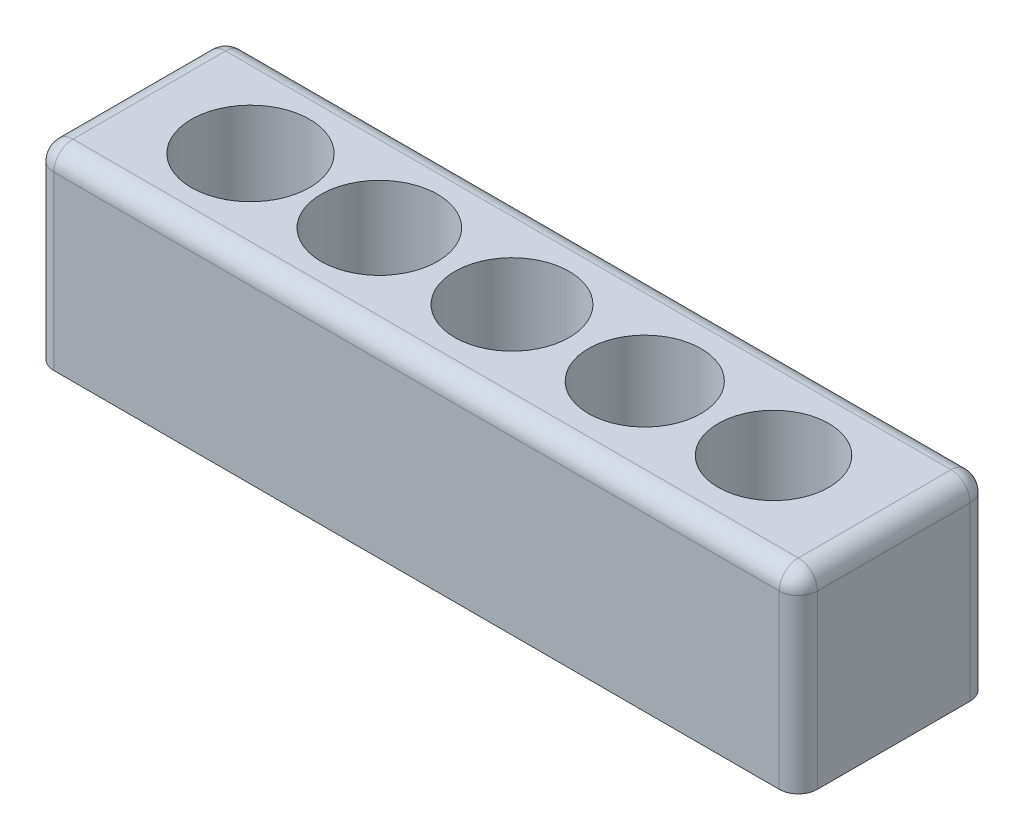
ISO-10303-21;
HEADER;
FILE_DESCRIPTION(('STEP AP214'),'2;1');
FILE_NAME('part.step','',(''),(''),'','','');
FILE_SCHEMA(('AUTOMOTIVE_DESIGN { 1 0 10303 214 1 1 1 1 }'));
ENDSEC;
DATA;
#1=APPLICATION_CONTEXT('core data for automotive mechanical design processes');
#2=APPLICATION_PROTOCOL_DEFINITION('international standard','automotive_design',2000,#1);
#3=PRODUCT_CONTEXT('',#1,'mechanical');
#4=PRODUCT('Part','Part','',(#3));
#5=PRODUCT_RELATED_PRODUCT_CATEGORY('part','',(#4));
#6=PRODUCT_DEFINITION_FORMATION('','',#4);
#7=PRODUCT_DEFINITION_CONTEXT('part definition',#1,'design');
#8=PRODUCT_DEFINITION('design','',#6,#7);
#9=PRODUCT_DEFINITION_SHAPE('','',#8);
#10=(LENGTH_UNIT() NAMED_UNIT(*) SI_UNIT(.MILLI.,.METRE.));
#11=(NAMED_UNIT(*) PLANE_ANGLE_UNIT() SI_UNIT($,.RADIAN.));
#12=(NAMED_UNIT(*) SI_UNIT($,.STERADIAN.) SOLID_ANGLE_UNIT());
#13=UNCERTAINTY_MEASURE_WITH_UNIT(LENGTH_MEASURE(1.E-05),#10,'distance_accuracy_value','');
#14=(GEOMETRIC_REPRESENTATION_CONTEXT(3) GLOBAL_UNCERTAINTY_ASSIGNED_CONTEXT((#13)) GLOBAL_UNIT_ASSIGNED_CONTEXT((#10,
#11,#12)) REPRESENTATION_CONTEXT('',''));
#15=CARTESIAN_POINT('',(0.,0.,0.));
#16=DIRECTION('',(0.,0.,1.));
#17=DIRECTION('',(1.,0.,0.));
#18=AXIS2_PLACEMENT_3D('',#15,#16,#17);
#19=CARTESIAN_POINT('',(-7.37993294009677,5.,2.59456372639682));
#20=DIRECTION('',(0.,0.,-1.));
#21=DIRECTION('',(-1.,0.,0.));
#22=AXIS2_PLACEMENT_3D('',#19,#20,#21);
#23=PLANE('',#22);
#24=DIRECTION('',(1.,0.,0.));
#25=VECTOR('',#24,1.);
#26=CARTESIAN_POINT('',(-8.87993294009677,4.5,2.59456372639682));
#27=LINE('',#26,#25);
#28=CARTESIAN_POINT('',(10.6200670599032,4.5,2.59456372639682));
#29=VERTEX_POINT('',#28);
#30=CARTESIAN_POINT('',(-8.37993294009677,4.5,2.59456372639682));
#31=VERTEX_POINT('',#30);
#32=EDGE_CURVE('E139',#29,#31,#27,.F.);
#33=ORIENTED_EDGE('',*,*,#32,.T.);
#34=DIRECTION('',(0.,1.,0.));
#35=VECTOR('',#34,1.);
#36=CARTESIAN_POINT('',(-8.37993294009677,0.,2.59456372639682));
#37=LINE('',#36,#35);
#38=CARTESIAN_POINT('',(-8.37993294009677,0.,2.59456372639682));
#39=VERTEX_POINT('',#38);
#40=EDGE_CURVE('E135',#31,#39,#37,.F.);
#41=ORIENTED_EDGE('',*,*,#40,.T.);
#42=DIRECTION('',(1.,0.,0.));
#43=VECTOR('',#42,1.);
#44=CARTESIAN_POINT('',(-7.37993294009677,0.,2.59456372639682));
#45=LINE('',#44,#43);
#46=CARTESIAN_POINT('',(10.6200670599032,0.,2.59456372639682));
#47=VERTEX_POINT('',#46);
#48=EDGE_CURVE('E230',#39,#47,#45,.T.);
#49=ORIENTED_EDGE('',*,*,#48,.T.);
#50=DIRECTION('',(0.,-1.,0.));
#51=VECTOR('',#50,1.);
#52=CARTESIAN_POINT('',(10.6200670599032,5.,2.59456372639682));
#53=LINE('',#52,#51);
#54=EDGE_CURVE('E239',#47,#29,#53,.F.);
#55=ORIENTED_EDGE('',*,*,#54,.T.);
#56=EDGE_LOOP('',(#33,#41,#49,#55));
#57=FACE_BOUND('',#56,.T.);
#58=ADVANCED_FACE('F33',(#57),#23,.F.);
#59=CARTESIAN_POINT('',(-7.37993294009677,5.,-2.40543627360318));
#60=DIRECTION('',(0.,0.,1.));
#61=DIRECTION('',(1.,0.,0.));
#62=AXIS2_PLACEMENT_3D('',#59,#60,#61);
#63=PLANE('',#62);
#64=DIRECTION('',(-1.,0.,0.));
#65=VECTOR('',#64,1.);
#66=CARTESIAN_POINT('',(11.1200670599032,4.5,-2.40543627360318));
#67=LINE('',#66,#65);
#68=CARTESIAN_POINT('',(-8.37993294009677,4.5,-2.40543627360318));
#69=VERTEX_POINT('',#68);
#70=CARTESIAN_POINT('',(10.6200670599032,4.5,-2.40543627360318));
#71=VERTEX_POINT('',#70);
#72=EDGE_CURVE('E42',#69,#71,#67,.F.);
#73=ORIENTED_EDGE('',*,*,#72,.T.);
#74=DIRECTION('',(0.,1.,0.));
#75=VECTOR('',#74,1.);
#76=CARTESIAN_POINT('',(10.6200670599032,0.,-2.40543627360318));
#77=LINE('',#76,#75);
#78=CARTESIAN_POINT('',(10.6200670599032,0.,-2.40543627360318));
#79=VERTEX_POINT('',#78);
#80=EDGE_CURVE('E11',#71,#79,#77,.F.);
#81=ORIENTED_EDGE('',*,*,#80,.T.);
#82=DIRECTION('',(-1.,0.,0.));
#83=VECTOR('',#82,1.);
#84=CARTESIAN_POINT('',(-7.37993294009677,0.,-2.40543627360318));
#85=LINE('',#84,#83);
#86=CARTESIAN_POINT('',(-8.37993294009677,0.,-2.40543627360318));
#87=VERTEX_POINT('',#86);
#88=EDGE_CURVE('E121',#79,#87,#85,.T.);
#89=ORIENTED_EDGE('',*,*,#88,.T.);
#90=DIRECTION('',(0.,-1.,0.));
#91=VECTOR('',#90,1.);
#92=CARTESIAN_POINT('',(-8.37993294009677,5.,-2.40543627360318));
#93=LINE('',#92,#91);
#94=EDGE_CURVE('E53',#87,#69,#93,.F.);
#95=ORIENTED_EDGE('',*,*,#94,.T.);
#96=EDGE_LOOP('',(#73,#81,#89,#95));
#97=FACE_BOUND('',#96,.T.);
#98=ADVANCED_FACE('F281',(#97),#63,.F.);
#99=CARTESIAN_POINT('',(0.,5.,0.));
#100=DIRECTION('',(0.,1.,0.));
#101=DIRECTION('',(0.,0.,1.));
#102=AXIS2_PLACEMENT_3D('',#99,#100,#101);
#103=PLANE('',#102);
#104=DIRECTION('',(0.,0.,-1.));
#105=VECTOR('',#104,1.);
#106=CARTESIAN_POINT('',(-8.37993294009677,5.,0.));
#107=LINE('',#106,#105);
#108=CARTESIAN_POINT('',(-8.37993294009677,5.,-1.90543627360318));
#109=VERTEX_POINT('',#108);
#110=CARTESIAN_POINT('',(-8.37993294009677,5.,2.09456372639682));
#111=VERTEX_POINT('',#110);
#112=EDGE_CURVE('E145',#109,#111,#107,.F.);
#113=ORIENTED_EDGE('',*,*,#112,.T.);
#114=DIRECTION('',(1.,0.,0.));
#115=VECTOR('',#114,1.);
#116=CARTESIAN_POINT('',(11.1200670599032,5.,2.09456372639682));
#117=LINE('',#116,#115);
#118=CARTESIAN_POINT('',(10.6200670599032,5.,2.09456372639682));
#119=VERTEX_POINT('',#118);
#120=EDGE_CURVE('E151',#111,#119,#117,.T.);
#121=ORIENTED_EDGE('',*,*,#120,.T.);
#122=DIRECTION('',(0.,0.,1.));
#123=VECTOR('',#122,1.);
#124=CARTESIAN_POINT('',(10.6200670599032,5.,0.));
#125=LINE('',#124,#123);
#126=CARTESIAN_POINT('',(10.6200670599032,5.,-1.90543627360318));
#127=VERTEX_POINT('',#126);
#128=EDGE_CURVE('E149',#119,#127,#125,.F.);
#129=ORIENTED_EDGE('',*,*,#128,.T.);
#130=DIRECTION('',(-1.,0.,0.));
#131=VECTOR('',#130,1.);
#132=CARTESIAN_POINT('',(-8.87993294009677,5.,-1.90543627360318));
#133=LINE('',#132,#131);
#134=EDGE_CURVE('E147',#127,#109,#133,.T.);
#135=ORIENTED_EDGE('',*,*,#134,.T.);
#136=EDGE_LOOP('',(#113,#121,#129,#135));
#137=FACE_BOUND('',#136,.T.);
#138=CARTESIAN_POINT('',(7.97006705990323,5.,0.0945637263968162));
#139=DIRECTION('',(0.,1.,0.));
#140=DIRECTION('',(0.,0.,1.));
#141=AXIS2_PLACEMENT_3D('',#138,#139,#140);
#142=CIRCLE('',#141,1.45);
#143=CARTESIAN_POINT('',(7.97006705990323,5.,1.54456372639682));
#144=VERTEX_POINT('',#143);
#145=EDGE_CURVE('E219',#144,#144,#142,.T.);
#146=ORIENTED_EDGE('',*,*,#145,.F.);
#147=EDGE_LOOP('',(#146));
#148=FACE_BOUND('',#147,.T.);
#149=CARTESIAN_POINT('',(-5.72993294009677,5.,0.0945637263968162));
#150=DIRECTION('',(0.,1.,0.));
#151=DIRECTION('',(0.,0.,1.));
#152=AXIS2_PLACEMENT_3D('',#149,#150,#151);
#153=CIRCLE('',#152,1.55);
#154=CARTESIAN_POINT('',(-5.72993294009677,5.,1.64456372639682));
#155=VERTEX_POINT('',#154);
#156=EDGE_CURVE('E206',#155,#155,#153,.T.);
#157=ORIENTED_EDGE('',*,*,#156,.F.);
#158=EDGE_LOOP('',(#157));
#159=FACE_BOUND('',#158,.T.);
#160=CARTESIAN_POINT('',(-2.35454987093083,5.,0.0945637263968162));
#161=DIRECTION('',(0.,1.,0.));
#162=DIRECTION('',(0.,0.,1.));
#163=AXIS2_PLACEMENT_3D('',#160,#161,#162);
#164=CIRCLE('',#163,1.525);
#165=CARTESIAN_POINT('',(-2.35454987093083,5.,1.61956372639682));
#166=VERTEX_POINT('',#165);
#167=EDGE_CURVE('E207',#166,#166,#164,.T.);
#168=ORIENTED_EDGE('',*,*,#167,.F.);
#169=EDGE_LOOP('',(#168));
#170=FACE_BOUND('',#169,.T.);
#171=CARTESIAN_POINT('',(4.59706982457561,5.,0.0945637263968162));
#172=DIRECTION('',(0.,1.,0.));
#173=DIRECTION('',(0.,0.,1.));
#174=AXIS2_PLACEMENT_3D('',#171,#172,#173);
#175=CIRCLE('',#174,1.475);
#176=CARTESIAN_POINT('',(4.59706982457561,5.,1.56956372639682));
#177=VERTEX_POINT('',#176);
#178=EDGE_CURVE('E130',#177,#177,#175,.T.);
#179=ORIENTED_EDGE('',*,*,#178,.F.);
#180=EDGE_LOOP('',(#179));
#181=FACE_BOUND('',#180,.T.);
#182=CARTESIAN_POINT('',(1.12006705990323,5.,0.0945637263968162));
#183=DIRECTION('',(0.,1.,0.));
#184=DIRECTION('',(0.,0.,1.));
#185=AXIS2_PLACEMENT_3D('',#182,#183,#184);
#186=CIRCLE('',#185,1.5);
#187=CARTESIAN_POINT('',(1.12006705990323,5.,1.59456372639682));
#188=VERTEX_POINT('',#187);
#189=EDGE_CURVE('E218',#188,#188,#186,.T.);
#190=ORIENTED_EDGE('',*,*,#189,.F.);
#191=EDGE_LOOP('',(#190));
#192=FACE_BOUND('',#191,.T.);
#193=ADVANCED_FACE('F264',(#137,#148,#159,#170,#181,#192),#103,.T.);
#194=CARTESIAN_POINT('',(0.,0.,0.));
#195=DIRECTION('',(0.,1.,0.));
#196=DIRECTION('',(0.,0.,1.));
#197=AXIS2_PLACEMENT_3D('',#194,#195,#196);
#198=PLANE('',#197);
#199=CARTESIAN_POINT('',(7.97006705990323,0.,0.0945637263968162));
#200=DIRECTION('',(0.,1.,0.));
#201=DIRECTION('',(0.,0.,1.));
#202=AXIS2_PLACEMENT_3D('',#199,#200,#201);
#203=CIRCLE('',#202,1.45);
#204=CARTESIAN_POINT('',(7.97006705990323,0.,1.54456372639682));
#205=VERTEX_POINT('',#204);
#206=EDGE_CURVE('E215',#205,#205,#203,.T.);
#207=ORIENTED_EDGE('',*,*,#206,.T.);
#208=EDGE_LOOP('',(#207));
#209=FACE_BOUND('',#208,.T.);
#210=CARTESIAN_POINT('',(-5.72993294009677,0.,0.0945637263968162));
#211=DIRECTION('',(0.,1.,0.));
#212=DIRECTION('',(0.,0.,1.));
#213=AXIS2_PLACEMENT_3D('',#210,#211,#212);
#214=CIRCLE('',#213,1.55);
#215=CARTESIAN_POINT('',(-5.72993294009677,0.,1.64456372639682));
#216=VERTEX_POINT('',#215);
#217=EDGE_CURVE('E222',#216,#216,#214,.T.);
#218=ORIENTED_EDGE('',*,*,#217,.T.);
#219=EDGE_LOOP('',(#218));
#220=FACE_BOUND('',#219,.T.);
#221=CARTESIAN_POINT('',(-2.35454987093083,0.,0.0945637263968162));
#222=DIRECTION('',(0.,1.,0.));
#223=DIRECTION('',(0.,0.,1.));
#224=AXIS2_PLACEMENT_3D('',#221,#222,#223);
#225=CIRCLE('',#224,1.525);
#226=CARTESIAN_POINT('',(-2.35454987093083,0.,1.61956372639682));
#227=VERTEX_POINT('',#226);
#228=EDGE_CURVE('E203',#227,#227,#225,.T.);
#229=ORIENTED_EDGE('',*,*,#228,.T.);
#230=EDGE_LOOP('',(#229));
#231=FACE_BOUND('',#230,.T.);
#232=CARTESIAN_POINT('',(4.59706982457561,0.,0.0945637263968162));
#233=DIRECTION('',(0.,1.,0.));
#234=DIRECTION('',(0.,0.,1.));
#235=AXIS2_PLACEMENT_3D('',#232,#233,#234);
#236=CIRCLE('',#235,1.475);
#237=CARTESIAN_POINT('',(4.59706982457561,0.,1.56956372639682));
#238=VERTEX_POINT('',#237);
#239=EDGE_CURVE('E210',#238,#238,#236,.T.);
#240=ORIENTED_EDGE('',*,*,#239,.T.);
#241=EDGE_LOOP('',(#240));
#242=FACE_BOUND('',#241,.T.);
#243=CARTESIAN_POINT('',(1.12006705990323,0.,0.0945637263968162));
#244=DIRECTION('',(0.,1.,0.));
#245=DIRECTION('',(0.,0.,1.));
#246=AXIS2_PLACEMENT_3D('',#243,#244,#245);
#247=CIRCLE('',#246,1.5);
#248=CARTESIAN_POINT('',(1.12006705990323,0.,1.59456372639682));
#249=VERTEX_POINT('',#248);
#250=EDGE_CURVE('E227',#249,#249,#247,.T.);
#251=ORIENTED_EDGE('',*,*,#250,.T.);
#252=EDGE_LOOP('',(#251));
#253=FACE_BOUND('',#252,.T.);
#254=ORIENTED_EDGE('',*,*,#48,.F.);
#255=CARTESIAN_POINT('',(-8.37993294009677,0.,2.09456372639682));
#256=DIRECTION('',(0.,1.,0.));
#257=DIRECTION('',(0.,0.,1.));
#258=AXIS2_PLACEMENT_3D('',#255,#256,#257);
#259=CIRCLE('',#258,0.5);
#260=CARTESIAN_POINT('',(-8.87993294009677,0.,2.09456372639682));
#261=VERTEX_POINT('',#260);
#262=EDGE_CURVE('E129',#39,#261,#259,.F.);
#263=ORIENTED_EDGE('',*,*,#262,.T.);
#264=DIRECTION('',(0.,0.,1.));
#265=VECTOR('',#264,1.);
#266=CARTESIAN_POINT('',(-8.87993294009677,0.,-2.40543627360318));
#267=LINE('',#266,#265);
#268=CARTESIAN_POINT('',(-8.87993294009677,0.,-1.90543627360318));
#269=VERTEX_POINT('',#268);
#270=EDGE_CURVE('E113',#269,#261,#267,.T.);
#271=ORIENTED_EDGE('',*,*,#270,.F.);
#272=CARTESIAN_POINT('',(-8.37993294009677,0.,-1.90543627360318));
#273=DIRECTION('',(0.,1.,0.));
#274=DIRECTION('',(0.,0.,1.));
#275=AXIS2_PLACEMENT_3D('',#272,#273,#274);
#276=CIRCLE('',#275,0.5);
#277=EDGE_CURVE('E127',#269,#87,#276,.F.);
#278=ORIENTED_EDGE('',*,*,#277,.T.);
#279=ORIENTED_EDGE('',*,*,#88,.F.);
#280=CARTESIAN_POINT('',(10.6200670599032,0.,-1.90543627360318));
#281=DIRECTION('',(0.,1.,0.));
#282=DIRECTION('',(0.,0.,1.));
#283=AXIS2_PLACEMENT_3D('',#280,#281,#282);
#284=CIRCLE('',#283,0.5);
#285=CARTESIAN_POINT('',(11.1200670599032,0.,-1.90543627360318));
#286=VERTEX_POINT('',#285);
#287=EDGE_CURVE('E134',#79,#286,#284,.F.);
#288=ORIENTED_EDGE('',*,*,#287,.T.);
#289=DIRECTION('',(0.,0.,-1.));
#290=VECTOR('',#289,1.);
#291=CARTESIAN_POINT('',(11.1200670599032,0.,2.59456372639682));
#292=LINE('',#291,#290);
#293=CARTESIAN_POINT('',(11.1200670599032,0.,2.09456372639682));
#294=VERTEX_POINT('',#293);
#295=EDGE_CURVE('E131',#294,#286,#292,.T.);
#296=ORIENTED_EDGE('',*,*,#295,.F.);
#297=CARTESIAN_POINT('',(10.6200670599032,0.,2.09456372639682));
#298=DIRECTION('',(0.,1.,0.));
#299=DIRECTION('',(0.,0.,1.));
#300=AXIS2_PLACEMENT_3D('',#297,#298,#299);
#301=CIRCLE('',#300,0.5);
#302=EDGE_CURVE('E137',#294,#47,#301,.F.);
#303=ORIENTED_EDGE('',*,*,#302,.T.);
#304=EDGE_LOOP('',(#254,#263,#271,#278,#279,#288,#296,#303));
#305=FACE_BOUND('',#304,.T.);
#306=ADVANCED_FACE('F125',(#209,#220,#231,#242,#253,#305),#198,.F.);
#307=CARTESIAN_POINT('',(1.12006705990323,0.,0.0945637263968162));
#308=DIRECTION('',(0.,1.,0.));
#309=DIRECTION('',(0.,0.,1.));
#310=AXIS2_PLACEMENT_3D('',#307,#308,#309);
#311=CYLINDRICAL_SURFACE('',#310,1.5);
#312=ORIENTED_EDGE('',*,*,#250,.F.);
#313=EDGE_LOOP('',(#312));
#314=FACE_BOUND('',#313,.T.);
#315=ORIENTED_EDGE('',*,*,#189,.T.);
#316=EDGE_LOOP('',(#315));
#317=FACE_BOUND('',#316,.T.);
#318=ADVANCED_FACE('F395',(#314,#317),#311,.F.);
#319=CARTESIAN_POINT('',(4.59706982457561,0.,0.0945637263968162));
#320=DIRECTION('',(0.,1.,0.));
#321=DIRECTION('',(0.,0.,1.));
#322=AXIS2_PLACEMENT_3D('',#319,#320,#321);
#323=CYLINDRICAL_SURFACE('',#322,1.475);
#324=ORIENTED_EDGE('',*,*,#239,.F.);
#325=EDGE_LOOP('',(#324));
#326=FACE_BOUND('',#325,.T.);
#327=ORIENTED_EDGE('',*,*,#178,.T.);
#328=EDGE_LOOP('',(#327));
#329=FACE_BOUND('',#328,.T.);
#330=ADVANCED_FACE('F450',(#326,#329),#323,.F.);
#331=CARTESIAN_POINT('',(-2.35454987093083,0.,0.0945637263968162));
#332=DIRECTION('',(0.,1.,0.));
#333=DIRECTION('',(0.,0.,1.));
#334=AXIS2_PLACEMENT_3D('',#331,#332,#333);
#335=CYLINDRICAL_SURFACE('',#334,1.525);
#336=ORIENTED_EDGE('',*,*,#228,.F.);
#337=EDGE_LOOP('',(#336));
#338=FACE_BOUND('',#337,.T.);
#339=ORIENTED_EDGE('',*,*,#167,.T.);
#340=EDGE_LOOP('',(#339));
#341=FACE_BOUND('',#340,.T.);
#342=ADVANCED_FACE('F447',(#338,#341),#335,.F.);
#343=CARTESIAN_POINT('',(-5.72993294009677,0.,0.0945637263968162));
#344=DIRECTION('',(0.,1.,0.));
#345=DIRECTION('',(0.,0.,1.));
#346=AXIS2_PLACEMENT_3D('',#343,#344,#345);
#347=CYLINDRICAL_SURFACE('',#346,1.55);
#348=ORIENTED_EDGE('',*,*,#217,.F.);
#349=EDGE_LOOP('',(#348));
#350=FACE_BOUND('',#349,.T.);
#351=ORIENTED_EDGE('',*,*,#156,.T.);
#352=EDGE_LOOP('',(#351));
#353=FACE_BOUND('',#352,.T.);
#354=ADVANCED_FACE('F443',(#350,#353),#347,.F.);
#355=CARTESIAN_POINT('',(7.97006705990323,0.,0.0945637263968162));
#356=DIRECTION('',(0.,1.,0.));
#357=DIRECTION('',(0.,0.,1.));
#358=AXIS2_PLACEMENT_3D('',#355,#356,#357);
#359=CYLINDRICAL_SURFACE('',#358,1.45);
#360=ORIENTED_EDGE('',*,*,#206,.F.);
#361=EDGE_LOOP('',(#360));
#362=FACE_BOUND('',#361,.T.);
#363=ORIENTED_EDGE('',*,*,#145,.T.);
#364=EDGE_LOOP('',(#363));
#365=FACE_BOUND('',#364,.T.);
#366=ADVANCED_FACE('F434',(#362,#365),#359,.F.);
#367=CARTESIAN_POINT('',(-8.87993294009677,0.,0.));
#368=DIRECTION('',(-1.,0.,0.));
#369=DIRECTION('',(0.,0.,1.));
#370=AXIS2_PLACEMENT_3D('',#367,#368,#369);
#371=PLANE('',#370);
#372=ORIENTED_EDGE('',*,*,#270,.T.);
#373=DIRECTION('',(0.,1.,0.));
#374=VECTOR('',#373,1.);
#375=CARTESIAN_POINT('',(-8.87993294009677,5.,2.09456372639682));
#376=LINE('',#375,#374);
#377=CARTESIAN_POINT('',(-8.87993294009677,4.5,2.09456372639682));
#378=VERTEX_POINT('',#377);
#379=EDGE_CURVE('E237',#261,#378,#376,.T.);
#380=ORIENTED_EDGE('',*,*,#379,.T.);
#381=DIRECTION('',(0.,0.,-1.));
#382=VECTOR('',#381,1.);
#383=CARTESIAN_POINT('',(-8.87993294009677,4.5,0.));
#384=LINE('',#383,#382);
#385=CARTESIAN_POINT('',(-8.87993294009677,4.5,-1.90543627360318));
#386=VERTEX_POINT('',#385);
#387=EDGE_CURVE('E116',#378,#386,#384,.T.);
#388=ORIENTED_EDGE('',*,*,#387,.T.);
#389=DIRECTION('',(0.,-1.,0.));
#390=VECTOR('',#389,1.);
#391=CARTESIAN_POINT('',(-8.87993294009677,0.,-1.90543627360318));
#392=LINE('',#391,#390);
#393=EDGE_CURVE('E109',#386,#269,#392,.T.);
#394=ORIENTED_EDGE('',*,*,#393,.T.);
#395=EDGE_LOOP('',(#372,#380,#388,#394));
#396=FACE_BOUND('',#395,.T.);
#397=ADVANCED_FACE('F111',(#396),#371,.T.);
#398=CARTESIAN_POINT('',(11.1200670599032,0.,0.));
#399=DIRECTION('',(1.,0.,0.));
#400=DIRECTION('',(0.,0.,-1.));
#401=AXIS2_PLACEMENT_3D('',#398,#399,#400);
#402=PLANE('',#401);
#403=DIRECTION('',(0.,0.,1.));
#404=VECTOR('',#403,1.);
#405=CARTESIAN_POINT('',(11.1200670599032,4.5,0.));
#406=LINE('',#405,#404);
#407=CARTESIAN_POINT('',(11.1200670599032,4.5,-1.90543627360318));
#408=VERTEX_POINT('',#407);
#409=CARTESIAN_POINT('',(11.1200670599032,4.5,2.09456372639682));
#410=VERTEX_POINT('',#409);
#411=EDGE_CURVE('E156',#408,#410,#406,.T.);
#412=ORIENTED_EDGE('',*,*,#411,.T.);
#413=DIRECTION('',(0.,-1.,0.));
#414=VECTOR('',#413,1.);
#415=CARTESIAN_POINT('',(11.1200670599032,0.,2.09456372639682));
#416=LINE('',#415,#414);
#417=EDGE_CURVE('E158',#410,#294,#416,.T.);
#418=ORIENTED_EDGE('',*,*,#417,.T.);
#419=ORIENTED_EDGE('',*,*,#295,.T.);
#420=DIRECTION('',(0.,1.,0.));
#421=VECTOR('',#420,1.);
#422=CARTESIAN_POINT('',(11.1200670599032,5.,-1.90543627360318));
#423=LINE('',#422,#421);
#424=EDGE_CURVE('E154',#286,#408,#423,.T.);
#425=ORIENTED_EDGE('',*,*,#424,.T.);
#426=EDGE_LOOP('',(#412,#418,#419,#425));
#427=FACE_BOUND('',#426,.T.);
#428=ADVANCED_FACE('F278',(#427),#402,.T.);
#429=CARTESIAN_POINT('',(10.6200670599032,0.,-1.90543627360318));
#430=DIRECTION('',(0.,-1.,0.));
#431=DIRECTION('',(0.,0.,-1.));
#432=AXIS2_PLACEMENT_3D('',#429,#430,#431);
#433=CYLINDRICAL_SURFACE('',#432,0.5);
#434=CARTESIAN_POINT('',(10.6200670599032,4.5,-1.90543627360318));
#435=DIRECTION('',(0.,1.,0.));
#436=DIRECTION('',(0.,0.,1.));
#437=AXIS2_PLACEMENT_3D('',#434,#435,#436);
#438=CIRCLE('',#437,0.5);
#439=EDGE_CURVE('E37',#408,#71,#438,.T.);
#440=ORIENTED_EDGE('',*,*,#439,.F.);
#441=ORIENTED_EDGE('',*,*,#424,.F.);
#442=ORIENTED_EDGE('',*,*,#287,.F.);
#443=ORIENTED_EDGE('',*,*,#80,.F.);
#444=EDGE_LOOP('',(#440,#441,#442,#443));
#445=FACE_BOUND('',#444,.T.);
#446=ADVANCED_FACE('F35',(#445),#433,.T.);
#447=CARTESIAN_POINT('',(10.6200670599032,4.5,-1.90543627360318));
#448=DIRECTION('',(0.,0.,1.));
#449=DIRECTION('',(1.,0.,0.));
#450=AXIS2_PLACEMENT_3D('',#447,#448,#449);
#451=SPHERICAL_SURFACE('',#450,0.5);
#452=CARTESIAN_POINT('',(10.6200670599032,4.5,-1.90543627360318));
#453=DIRECTION('',(0.,0.,-1.));
#454=DIRECTION('',(-1.,0.,0.));
#455=AXIS2_PLACEMENT_3D('',#452,#453,#454);
#456=CIRCLE('',#455,0.5);
#457=EDGE_CURVE('E186',#408,#127,#456,.F.);
#458=ORIENTED_EDGE('',*,*,#457,.F.);
#459=ORIENTED_EDGE('',*,*,#439,.T.);
#460=CARTESIAN_POINT('',(10.6200670599032,4.5,-1.90543627360318));
#461=DIRECTION('',(1.,0.,0.));
#462=DIRECTION('',(0.,0.,-1.));
#463=AXIS2_PLACEMENT_3D('',#460,#461,#462);
#464=CIRCLE('',#463,0.5);
#465=EDGE_CURVE('E188',#127,#71,#464,.F.);
#466=ORIENTED_EDGE('',*,*,#465,.F.);
#467=EDGE_LOOP('',(#458,#459,#466));
#468=FACE_BOUND('',#467,.T.);
#469=ADVANCED_FACE('F271',(#468),#451,.T.);
#470=CARTESIAN_POINT('',(-8.37993294009677,0.,-1.90543627360318));
#471=DIRECTION('',(0.,1.,0.));
#472=DIRECTION('',(0.,0.,1.));
#473=AXIS2_PLACEMENT_3D('',#470,#471,#472);
#474=CYLINDRICAL_SURFACE('',#473,0.5);
#475=ORIENTED_EDGE('',*,*,#277,.F.);
#476=ORIENTED_EDGE('',*,*,#393,.F.);
#477=CARTESIAN_POINT('',(-8.37993294009677,4.5,-1.90543627360318));
#478=DIRECTION('',(0.,1.,0.));
#479=DIRECTION('',(0.,0.,1.));
#480=AXIS2_PLACEMENT_3D('',#477,#478,#479);
#481=CIRCLE('',#480,0.5);
#482=EDGE_CURVE('E184',#69,#386,#481,.T.);
#483=ORIENTED_EDGE('',*,*,#482,.F.);
#484=ORIENTED_EDGE('',*,*,#94,.F.);
#485=EDGE_LOOP('',(#475,#476,#483,#484));
#486=FACE_BOUND('',#485,.T.);
#487=ADVANCED_FACE('F133',(#486),#474,.T.);
#488=CARTESIAN_POINT('',(0.,4.5,-1.90543627360318));
#489=DIRECTION('',(1.,0.,0.));
#490=DIRECTION('',(0.,0.,-1.));
#491=AXIS2_PLACEMENT_3D('',#488,#489,#490);
#492=CYLINDRICAL_SURFACE('',#491,0.5);
#493=ORIENTED_EDGE('',*,*,#465,.T.);
#494=ORIENTED_EDGE('',*,*,#72,.F.);
#495=CARTESIAN_POINT('',(-8.37993294009677,4.5,-1.90543627360318));
#496=DIRECTION('',(-1.,0.,0.));
#497=DIRECTION('',(0.,0.,1.));
#498=AXIS2_PLACEMENT_3D('',#495,#496,#497);
#499=CIRCLE('',#498,0.5);
#500=EDGE_CURVE('E181',#109,#69,#499,.T.);
#501=ORIENTED_EDGE('',*,*,#500,.F.);
#502=ORIENTED_EDGE('',*,*,#134,.F.);
#503=EDGE_LOOP('',(#493,#494,#501,#502));
#504=FACE_BOUND('',#503,.T.);
#505=ADVANCED_FACE('F262',(#504),#492,.T.);
#506=CARTESIAN_POINT('',(10.6200670599032,4.5,0.));
#507=DIRECTION('',(0.,0.,1.));
#508=DIRECTION('',(1.,0.,0.));
#509=AXIS2_PLACEMENT_3D('',#506,#507,#508);
#510=CYLINDRICAL_SURFACE('',#509,0.5);
#511=ORIENTED_EDGE('',*,*,#457,.T.);
#512=ORIENTED_EDGE('',*,*,#128,.F.);
#513=CARTESIAN_POINT('',(10.6200670599032,4.5,2.09456372639682));
#514=DIRECTION('',(0.,0.,1.));
#515=DIRECTION('',(1.,0.,0.));
#516=AXIS2_PLACEMENT_3D('',#513,#514,#515);
#517=CIRCLE('',#516,0.5);
#518=EDGE_CURVE('E178',#410,#119,#517,.T.);
#519=ORIENTED_EDGE('',*,*,#518,.F.);
#520=ORIENTED_EDGE('',*,*,#411,.F.);
#521=EDGE_LOOP('',(#511,#512,#519,#520));
#522=FACE_BOUND('',#521,.T.);
#523=ADVANCED_FACE('F270',(#522),#510,.T.);
#524=CARTESIAN_POINT('',(10.6200670599032,0.,2.09456372639682));
#525=DIRECTION('',(0.,1.,0.));
#526=DIRECTION('',(0.,0.,1.));
#527=AXIS2_PLACEMENT_3D('',#524,#525,#526);
#528=CYLINDRICAL_SURFACE('',#527,0.5);
#529=ORIENTED_EDGE('',*,*,#302,.F.);
#530=ORIENTED_EDGE('',*,*,#417,.F.);
#531=CARTESIAN_POINT('',(10.6200670599032,4.5,2.09456372639682));
#532=DIRECTION('',(0.,1.,0.));
#533=DIRECTION('',(0.,0.,1.));
#534=AXIS2_PLACEMENT_3D('',#531,#532,#533);
#535=CIRCLE('',#534,0.5);
#536=EDGE_CURVE('E175',#29,#410,#535,.T.);
#537=ORIENTED_EDGE('',*,*,#536,.F.);
#538=ORIENTED_EDGE('',*,*,#54,.F.);
#539=EDGE_LOOP('',(#529,#530,#537,#538));
#540=FACE_BOUND('',#539,.T.);
#541=ADVANCED_FACE('F304',(#540),#528,.T.);
#542=CARTESIAN_POINT('',(-8.37993294009677,4.5,-1.90543627360318));
#543=DIRECTION('',(0.,0.,1.));
#544=DIRECTION('',(1.,0.,0.));
#545=AXIS2_PLACEMENT_3D('',#542,#543,#544);
#546=SPHERICAL_SURFACE('',#545,0.5);
#547=ORIENTED_EDGE('',*,*,#500,.T.);
#548=ORIENTED_EDGE('',*,*,#482,.T.);
#549=CARTESIAN_POINT('',(-8.37993294009677,4.5,-1.90543627360318));
#550=DIRECTION('',(0.,0.,-1.));
#551=DIRECTION('',(-1.,0.,0.));
#552=AXIS2_PLACEMENT_3D('',#549,#550,#551);
#553=CIRCLE('',#552,0.5);
#554=EDGE_CURVE('E172',#109,#386,#553,.F.);
#555=ORIENTED_EDGE('',*,*,#554,.F.);
#556=EDGE_LOOP('',(#547,#548,#555));
#557=FACE_BOUND('',#556,.T.);
#558=ADVANCED_FACE('F260',(#557),#546,.T.);
#559=CARTESIAN_POINT('',(10.6200670599032,4.5,2.09456372639682));
#560=DIRECTION('',(0.,0.,1.));
#561=DIRECTION('',(1.,0.,0.));
#562=AXIS2_PLACEMENT_3D('',#559,#560,#561);
#563=SPHERICAL_SURFACE('',#562,0.5);
#564=ORIENTED_EDGE('',*,*,#536,.T.);
#565=ORIENTED_EDGE('',*,*,#518,.T.);
#566=CARTESIAN_POINT('',(10.6200670599032,4.5,2.09456372639682));
#567=DIRECTION('',(1.,0.,0.));
#568=DIRECTION('',(0.,0.,-1.));
#569=AXIS2_PLACEMENT_3D('',#566,#567,#568);
#570=CIRCLE('',#569,0.5);
#571=EDGE_CURVE('E170',#29,#119,#570,.F.);
#572=ORIENTED_EDGE('',*,*,#571,.F.);
#573=EDGE_LOOP('',(#564,#565,#572));
#574=FACE_BOUND('',#573,.T.);
#575=ADVANCED_FACE('F298',(#574),#563,.T.);
#576=CARTESIAN_POINT('',(-8.37993294009677,4.5,0.));
#577=DIRECTION('',(0.,0.,-1.));
#578=DIRECTION('',(-1.,0.,0.));
#579=AXIS2_PLACEMENT_3D('',#576,#577,#578);
#580=CYLINDRICAL_SURFACE('',#579,0.5);
#581=ORIENTED_EDGE('',*,*,#554,.T.);
#582=ORIENTED_EDGE('',*,*,#387,.F.);
#583=CARTESIAN_POINT('',(-8.37993294009677,4.5,2.09456372639682));
#584=DIRECTION('',(0.,0.,1.));
#585=DIRECTION('',(1.,0.,0.));
#586=AXIS2_PLACEMENT_3D('',#583,#584,#585);
#587=CIRCLE('',#586,0.5);
#588=EDGE_CURVE('E167',#111,#378,#587,.T.);
#589=ORIENTED_EDGE('',*,*,#588,.F.);
#590=ORIENTED_EDGE('',*,*,#112,.F.);
#591=EDGE_LOOP('',(#581,#582,#589,#590));
#592=FACE_BOUND('',#591,.T.);
#593=ADVANCED_FACE('F257',(#592),#580,.T.);
#594=CARTESIAN_POINT('',(0.,4.5,2.09456372639682));
#595=DIRECTION('',(-1.,0.,0.));
#596=DIRECTION('',(0.,0.,1.));
#597=AXIS2_PLACEMENT_3D('',#594,#595,#596);
#598=CYLINDRICAL_SURFACE('',#597,0.5);
#599=ORIENTED_EDGE('',*,*,#571,.T.);
#600=ORIENTED_EDGE('',*,*,#120,.F.);
#601=CARTESIAN_POINT('',(-8.37993294009677,4.5,2.09456372639682));
#602=DIRECTION('',(-1.,0.,0.));
#603=DIRECTION('',(0.,0.,1.));
#604=AXIS2_PLACEMENT_3D('',#601,#602,#603);
#605=CIRCLE('',#604,0.5);
#606=EDGE_CURVE('E164',#31,#111,#605,.T.);
#607=ORIENTED_EDGE('',*,*,#606,.F.);
#608=ORIENTED_EDGE('',*,*,#32,.F.);
#609=EDGE_LOOP('',(#599,#600,#607,#608));
#610=FACE_BOUND('',#609,.T.);
#611=ADVANCED_FACE('F248',(#610),#598,.T.);
#612=CARTESIAN_POINT('',(-8.37993294009677,4.5,2.09456372639682));
#613=DIRECTION('',(0.,0.,1.));
#614=DIRECTION('',(1.,0.,0.));
#615=AXIS2_PLACEMENT_3D('',#612,#613,#614);
#616=SPHERICAL_SURFACE('',#615,0.5);
#617=ORIENTED_EDGE('',*,*,#606,.T.);
#618=ORIENTED_EDGE('',*,*,#588,.T.);
#619=CARTESIAN_POINT('',(-8.37993294009677,4.5,2.09456372639682));
#620=DIRECTION('',(0.,1.,0.));
#621=DIRECTION('',(0.,0.,1.));
#622=AXIS2_PLACEMENT_3D('',#619,#620,#621);
#623=CIRCLE('',#622,0.5);
#624=EDGE_CURVE('E162',#31,#378,#623,.F.);
#625=ORIENTED_EDGE('',*,*,#624,.F.);
#626=EDGE_LOOP('',(#617,#618,#625));
#627=FACE_BOUND('',#626,.T.);
#628=ADVANCED_FACE('F254',(#627),#616,.T.);
#629=CARTESIAN_POINT('',(-8.37993294009677,0.,2.09456372639682));
#630=DIRECTION('',(0.,-1.,0.));
#631=DIRECTION('',(0.,0.,-1.));
#632=AXIS2_PLACEMENT_3D('',#629,#630,#631);
#633=CYLINDRICAL_SURFACE('',#632,0.5);
#634=ORIENTED_EDGE('',*,*,#262,.F.);
#635=ORIENTED_EDGE('',*,*,#40,.F.);
#636=ORIENTED_EDGE('',*,*,#624,.T.);
#637=ORIENTED_EDGE('',*,*,#379,.F.);
#638=EDGE_LOOP('',(#634,#635,#636,#637));
#639=FACE_BOUND('',#638,.T.);
#640=ADVANCED_FACE('F253',(#639),#633,.T.);
#641=CLOSED_SHELL('',(#58,#98,#193,#306,#318,#330,#342,#354,#366,#397,#428,#446,#469,#487,#505,
#523,#541,#558,#575,#593,#611,#628,#640));
#642=MANIFOLD_SOLID_BREP('B2',#641);
#643=ADVANCED_BREP_SHAPE_REPRESENTATION('',(#18,#642),#14);
#644=SHAPE_DEFINITION_REPRESENTATION(#9,#643);
ENDSEC;
END-ISO-10303-21;
